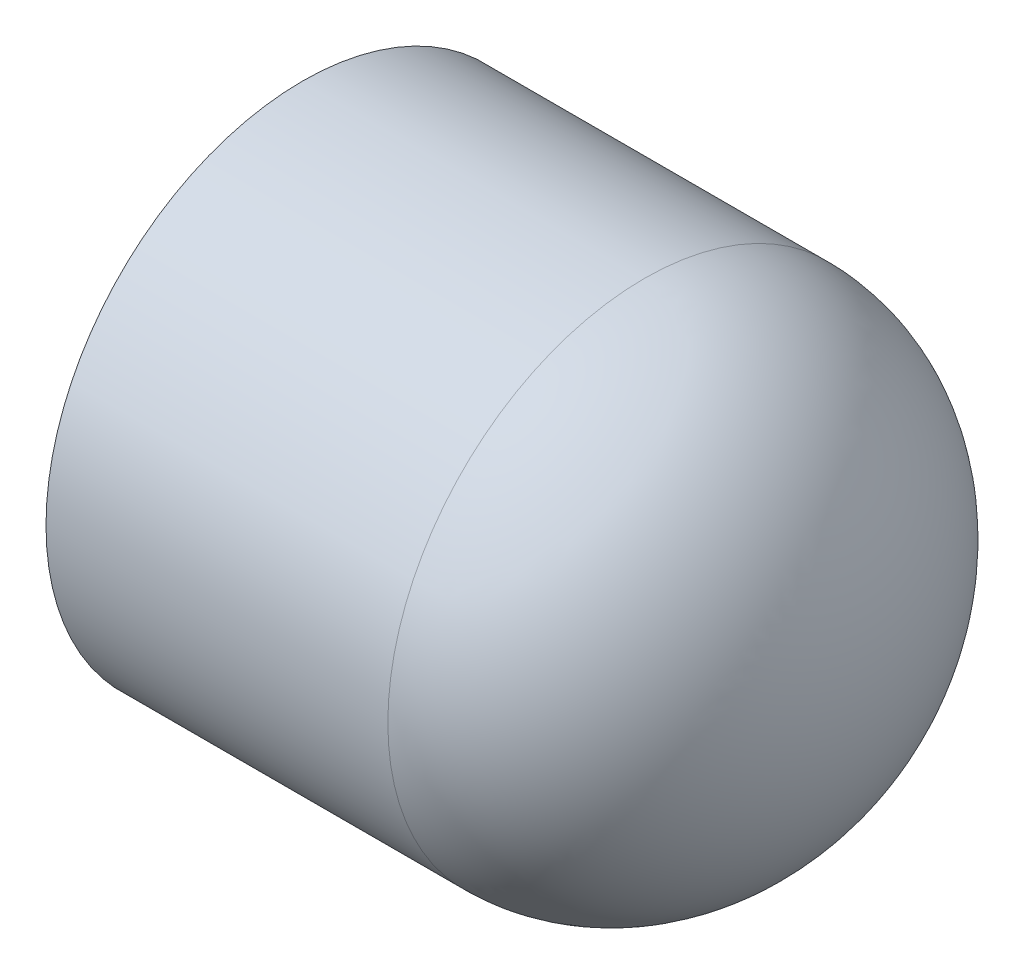
ISO-10303-21;
HEADER;
FILE_DESCRIPTION(('STEP AP214'),'2;1');
FILE_NAME('part.step','',(''),(''),'','','');
FILE_SCHEMA(('AUTOMOTIVE_DESIGN { 1 0 10303 214 1 1 1 1 }'));
ENDSEC;
DATA;
#1=APPLICATION_CONTEXT('core data for automotive mechanical design processes');
#2=APPLICATION_PROTOCOL_DEFINITION('international standard','automotive_design',2000,#1);
#3=PRODUCT_CONTEXT('',#1,'mechanical');
#4=PRODUCT('Part','Part','',(#3));
#5=PRODUCT_RELATED_PRODUCT_CATEGORY('part','',(#4));
#6=PRODUCT_DEFINITION_FORMATION('','',#4);
#7=PRODUCT_DEFINITION_CONTEXT('part definition',#1,'design');
#8=PRODUCT_DEFINITION('design','',#6,#7);
#9=PRODUCT_DEFINITION_SHAPE('','',#8);
#10=(LENGTH_UNIT() NAMED_UNIT(*) SI_UNIT(.MILLI.,.METRE.));
#11=(NAMED_UNIT(*) PLANE_ANGLE_UNIT() SI_UNIT($,.RADIAN.));
#12=(NAMED_UNIT(*) SI_UNIT($,.STERADIAN.) SOLID_ANGLE_UNIT());
#13=UNCERTAINTY_MEASURE_WITH_UNIT(LENGTH_MEASURE(1.E-05),#10,'distance_accuracy_value','');
#14=(GEOMETRIC_REPRESENTATION_CONTEXT(3) GLOBAL_UNCERTAINTY_ASSIGNED_CONTEXT((#13)) GLOBAL_UNIT_ASSIGNED_CONTEXT((#10,
#11,#12)) REPRESENTATION_CONTEXT('',''));
#15=CARTESIAN_POINT('',(0.,0.,0.));
#16=DIRECTION('',(0.,0.,1.));
#17=DIRECTION('',(1.,0.,0.));
#18=AXIS2_PLACEMENT_3D('',#15,#16,#17);
#19=CARTESIAN_POINT('',(-14.7193,0.,0.));
#20=DIRECTION('',(-1.,0.,0.));
#21=DIRECTION('',(0.,0.,1.));
#22=AXIS2_PLACEMENT_3D('',#19,#20,#21);
#23=CYLINDRICAL_SURFACE('',#22,13.6144);
#24=CARTESIAN_POINT('',(3.4163,0.,0.));
#25=DIRECTION('',(-1.,0.,0.));
#26=DIRECTION('',(0.,0.,1.));
#27=AXIS2_PLACEMENT_3D('',#24,#25,#26);
#28=CIRCLE('',#27,13.6144);
#29=CARTESIAN_POINT('',(3.4163,0.,13.6144));
#30=VERTEX_POINT('',#29);
#31=EDGE_CURVE('E11',#30,#30,#28,.T.);
#32=ORIENTED_EDGE('',*,*,#31,.T.);
#33=EDGE_LOOP('',(#32));
#34=FACE_BOUND('',#33,.T.);
#35=CARTESIAN_POINT('',(-14.7193,0.,0.));
#36=DIRECTION('',(-1.,0.,0.));
#37=DIRECTION('',(0.,0.,1.));
#38=AXIS2_PLACEMENT_3D('',#35,#36,#37);
#39=CIRCLE('',#38,13.6144);
#40=CARTESIAN_POINT('',(-14.7193,0.,13.6144));
#41=VERTEX_POINT('',#40);
#42=EDGE_CURVE('E57',#41,#41,#39,.T.);
#43=ORIENTED_EDGE('',*,*,#42,.F.);
#44=EDGE_LOOP('',(#43));
#45=FACE_BOUND('',#44,.T.);
#46=ADVANCED_FACE('F34',(#34,#45),#23,.T.);
#47=CARTESIAN_POINT('',(3.4163,0.,0.));
#48=DIRECTION('',(0.,0.,1.));
#49=DIRECTION('',(0.,1.,0.));
#50=AXIS2_PLACEMENT_3D('',#47,#48,#49);
#51=ELLIPSE('',#50,13.6144,11.303);
#52=TRIMMED_CURVE('',#51,(PARAMETER_VALUE(1.5707963267949)),(PARAMETER_VALUE(4.71238898038469)),
.T.,.PARAMETER.);
#53=CARTESIAN_POINT('',(-14.7193,0.,0.));
#54=DIRECTION('',(-1.,0.,0.));
#55=AXIS1_PLACEMENT('',#53,#54);
#56=SURFACE_OF_REVOLUTION('',#52,#55);
#57=CARTESIAN_POINT('',(14.7193,0.,0.));
#58=VERTEX_POINT('',#57);
#59=VERTEX_LOOP('',#58);
#60=FACE_BOUND('',#59,.T.);
#61=ORIENTED_EDGE('',*,*,#31,.F.);
#62=EDGE_LOOP('',(#61));
#63=FACE_BOUND('',#62,.T.);
#64=ADVANCED_FACE('F47',(#60,#63),#56,.F.);
#65=CARTESIAN_POINT('',(3.4163,0.,0.));
#66=DIRECTION('',(0.,0.,-1.));
#67=DIRECTION('',(0.,-1.,0.));
#68=AXIS2_PLACEMENT_3D('',#65,#66,#67);
#69=ELLIPSE('',#68,10.6172,8.30579999999999);
#70=TRIMMED_CURVE('',#69,(PARAMETER_VALUE(4.71238898038469)),
(PARAMETER_VALUE(7.85398163397448)),.T.,.PARAMETER.);
#71=CARTESIAN_POINT('',(-14.7193,0.,0.));
#72=DIRECTION('',(-1.,0.,0.));
#73=AXIS1_PLACEMENT('',#71,#72);
#74=SURFACE_OF_REVOLUTION('',#70,#73);
#75=CARTESIAN_POINT('',(3.4163,0.,0.));
#76=DIRECTION('',(-1.,0.,0.));
#77=DIRECTION('',(0.,0.,1.));
#78=AXIS2_PLACEMENT_3D('',#75,#76,#77);
#79=CIRCLE('',#78,10.6172);
#80=CARTESIAN_POINT('',(3.4163,0.,10.6172));
#81=VERTEX_POINT('',#80);
#82=EDGE_CURVE('E41',#81,#81,#79,.T.);
#83=ORIENTED_EDGE('',*,*,#82,.T.);
#84=EDGE_LOOP('',(#83));
#85=FACE_BOUND('',#84,.T.);
#86=CARTESIAN_POINT('',(11.7221,0.,0.));
#87=VERTEX_POINT('',#86);
#88=VERTEX_LOOP('',#87);
#89=FACE_BOUND('',#88,.T.);
#90=ADVANCED_FACE('F50',(#85,#89),#74,.F.);
#91=CARTESIAN_POINT('',(3.4163,0.,0.));
#92=DIRECTION('',(-1.,0.,0.));
#93=DIRECTION('',(0.,0.,1.));
#94=AXIS2_PLACEMENT_3D('',#91,#92,#93);
#95=CONICAL_SURFACE('',#94,10.6172,0.00840316354764701);
#96=CARTESIAN_POINT('',(-14.7193,0.,0.));
#97=DIRECTION('',(-1.,0.,0.));
#98=DIRECTION('',(0.,0.,1.));
#99=AXIS2_PLACEMENT_3D('',#96,#97,#98);
#100=CIRCLE('',#99,10.7696);
#101=CARTESIAN_POINT('',(-14.7193,0.,10.7696));
#102=VERTEX_POINT('',#101);
#103=EDGE_CURVE('E59',#102,#102,#100,.T.);
#104=ORIENTED_EDGE('',*,*,#103,.T.);
#105=EDGE_LOOP('',(#104));
#106=FACE_BOUND('',#105,.T.);
#107=ORIENTED_EDGE('',*,*,#82,.F.);
#108=EDGE_LOOP('',(#107));
#109=FACE_BOUND('',#108,.T.);
#110=ADVANCED_FACE('F70',(#106,#109),#95,.F.);
#111=CARTESIAN_POINT('',(-14.7193,-13.6144,0.));
#112=DIRECTION('',(-1.,0.,0.));
#113=DIRECTION('',(0.,0.,1.));
#114=AXIS2_PLACEMENT_3D('',#111,#112,#113);
#115=PLANE('',#114);
#116=ORIENTED_EDGE('',*,*,#42,.T.);
#117=EDGE_LOOP('',(#116));
#118=FACE_BOUND('',#117,.T.);
#119=ORIENTED_EDGE('',*,*,#103,.F.);
#120=EDGE_LOOP('',(#119));
#121=FACE_BOUND('',#120,.T.);
#122=ADVANCED_FACE('F72',(#118,#121),#115,.T.);
#123=CLOSED_SHELL('',(#46,#64,#90,#110,#122));
#124=MANIFOLD_SOLID_BREP('B2',#123);
#125=ADVANCED_BREP_SHAPE_REPRESENTATION('',(#18,#124),#14);
#126=SHAPE_DEFINITION_REPRESENTATION(#9,#125);
ENDSEC;
END-ISO-10303-21;
